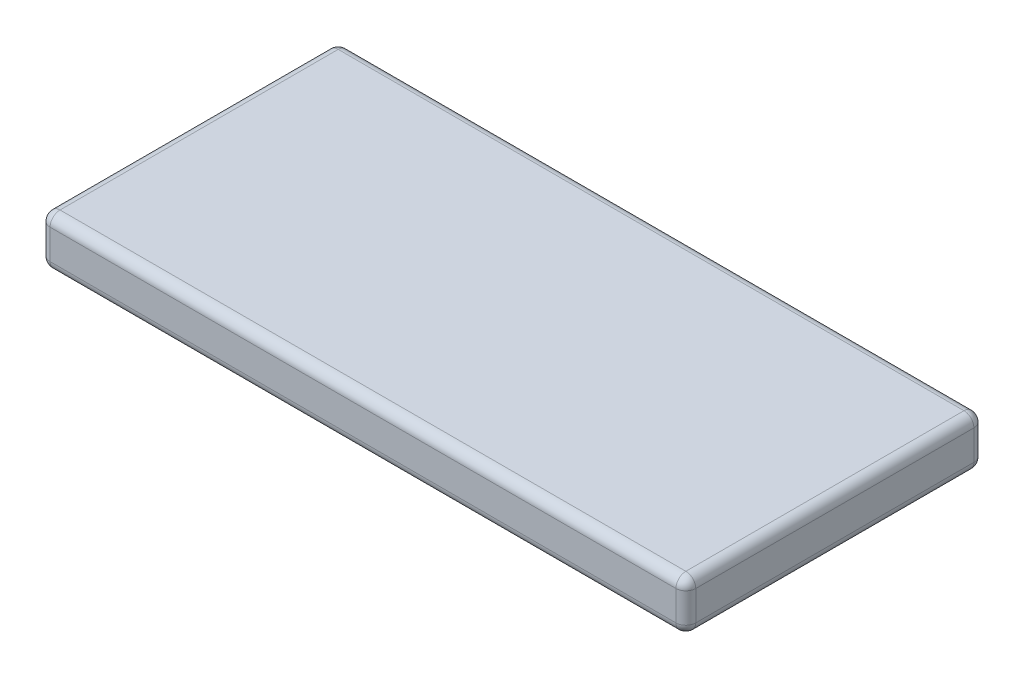
ISO-10303-21;
HEADER;
FILE_DESCRIPTION(('STEP AP214'),'2;1');
FILE_NAME('part.step','',(''),(''),'','','');
FILE_SCHEMA(('AUTOMOTIVE_DESIGN { 1 0 10303 214 1 1 1 1 }'));
ENDSEC;
DATA;
#1=APPLICATION_CONTEXT('core data for automotive mechanical design processes');
#2=APPLICATION_PROTOCOL_DEFINITION('international standard','automotive_design',2000,#1);
#3=PRODUCT_CONTEXT('',#1,'mechanical');
#4=PRODUCT('Part','Part','',(#3));
#5=PRODUCT_RELATED_PRODUCT_CATEGORY('part','',(#4));
#6=PRODUCT_DEFINITION_FORMATION('','',#4);
#7=PRODUCT_DEFINITION_CONTEXT('part definition',#1,'design');
#8=PRODUCT_DEFINITION('design','',#6,#7);
#9=PRODUCT_DEFINITION_SHAPE('','',#8);
#10=(LENGTH_UNIT() NAMED_UNIT(*) SI_UNIT(.MILLI.,.METRE.));
#11=(NAMED_UNIT(*) PLANE_ANGLE_UNIT() SI_UNIT($,.RADIAN.));
#12=(NAMED_UNIT(*) SI_UNIT($,.STERADIAN.) SOLID_ANGLE_UNIT());
#13=UNCERTAINTY_MEASURE_WITH_UNIT(LENGTH_MEASURE(1.E-05),#10,'distance_accuracy_value','');
#14=(GEOMETRIC_REPRESENTATION_CONTEXT(3) GLOBAL_UNCERTAINTY_ASSIGNED_CONTEXT((#13)) GLOBAL_UNIT_ASSIGNED_CONTEXT((#10,
#11,#12)) REPRESENTATION_CONTEXT('',''));
#15=CARTESIAN_POINT('',(0.,0.,0.));
#16=DIRECTION('',(0.,0.,1.));
#17=DIRECTION('',(1.,0.,0.));
#18=AXIS2_PLACEMENT_3D('',#15,#16,#17);
#19=CARTESIAN_POINT('',(32.5,5.,-15.));
#20=DIRECTION('',(-1.,0.,0.));
#21=DIRECTION('',(0.,0.,1.));
#22=AXIS2_PLACEMENT_3D('',#19,#20,#21);
#23=PLANE('',#22);
#24=DIRECTION('',(0.,-1.,0.));
#25=VECTOR('',#24,1.);
#26=CARTESIAN_POINT('',(32.5,5.,-14.));
#27=LINE('',#26,#25);
#28=CARTESIAN_POINT('',(32.5,1.,-14.));
#29=VERTEX_POINT('',#28);
#30=CARTESIAN_POINT('',(32.5,4.,-14.));
#31=VERTEX_POINT('',#30);
#32=EDGE_CURVE('E196',#29,#31,#27,.F.);
#33=ORIENTED_EDGE('',*,*,#32,.T.);
#34=DIRECTION('',(0.,0.,-1.));
#35=VECTOR('',#34,1.);
#36=CARTESIAN_POINT('',(32.5,4.,15.));
#37=LINE('',#36,#35);
#38=CARTESIAN_POINT('',(32.5,4.,14.));
#39=VERTEX_POINT('',#38);
#40=EDGE_CURVE('E199',#31,#39,#37,.F.);
#41=ORIENTED_EDGE('',*,*,#40,.T.);
#42=DIRECTION('',(0.,-1.,0.));
#43=VECTOR('',#42,1.);
#44=CARTESIAN_POINT('',(32.5,5.,14.));
#45=LINE('',#44,#43);
#46=CARTESIAN_POINT('',(32.5,1.,14.));
#47=VERTEX_POINT('',#46);
#48=EDGE_CURVE('E194',#39,#47,#45,.T.);
#49=ORIENTED_EDGE('',*,*,#48,.T.);
#50=DIRECTION('',(0.,0.,-1.));
#51=VECTOR('',#50,1.);
#52=CARTESIAN_POINT('',(32.5,1.,-15.));
#53=LINE('',#52,#51);
#54=EDGE_CURVE('E192',#47,#29,#53,.T.);
#55=ORIENTED_EDGE('',*,*,#54,.T.);
#56=EDGE_LOOP('',(#33,#41,#49,#55));
#57=FACE_BOUND('',#56,.T.);
#58=ADVANCED_FACE('F33',(#57),#23,.F.);
#59=CARTESIAN_POINT('',(-32.5,5.,-15.));
#60=DIRECTION('',(0.,0.,1.));
#61=DIRECTION('',(1.,0.,0.));
#62=AXIS2_PLACEMENT_3D('',#59,#60,#61);
#63=PLANE('',#62);
#64=DIRECTION('',(-1.,0.,0.));
#65=VECTOR('',#64,1.);
#66=CARTESIAN_POINT('',(-32.5,1.,-15.));
#67=LINE('',#66,#65);
#68=CARTESIAN_POINT('',(31.5,1.,-15.));
#69=VERTEX_POINT('',#68);
#70=CARTESIAN_POINT('',(-31.5,1.,-15.));
#71=VERTEX_POINT('',#70);
#72=EDGE_CURVE('E169',#69,#71,#67,.T.);
#73=ORIENTED_EDGE('',*,*,#72,.T.);
#74=DIRECTION('',(0.,-1.,0.));
#75=VECTOR('',#74,1.);
#76=CARTESIAN_POINT('',(-31.5,5.,-15.));
#77=LINE('',#76,#75);
#78=CARTESIAN_POINT('',(-31.5,4.,-15.));
#79=VERTEX_POINT('',#78);
#80=EDGE_CURVE('E171',#71,#79,#77,.F.);
#81=ORIENTED_EDGE('',*,*,#80,.T.);
#82=DIRECTION('',(-1.,0.,0.));
#83=VECTOR('',#82,1.);
#84=CARTESIAN_POINT('',(32.5,4.,-15.));
#85=LINE('',#84,#83);
#86=CARTESIAN_POINT('',(31.5,4.,-15.));
#87=VERTEX_POINT('',#86);
#88=EDGE_CURVE('E167',#79,#87,#85,.F.);
#89=ORIENTED_EDGE('',*,*,#88,.T.);
#90=DIRECTION('',(0.,-1.,0.));
#91=VECTOR('',#90,1.);
#92=CARTESIAN_POINT('',(31.5,5.,-15.));
#93=LINE('',#92,#91);
#94=EDGE_CURVE('E165',#87,#69,#93,.T.);
#95=ORIENTED_EDGE('',*,*,#94,.T.);
#96=EDGE_LOOP('',(#73,#81,#89,#95));
#97=FACE_BOUND('',#96,.T.);
#98=ADVANCED_FACE('F327',(#97),#63,.F.);
#99=CARTESIAN_POINT('',(-32.5,5.,-15.));
#100=DIRECTION('',(1.,0.,0.));
#101=DIRECTION('',(0.,0.,-1.));
#102=AXIS2_PLACEMENT_3D('',#99,#100,#101);
#103=PLANE('',#102);
#104=DIRECTION('',(0.,0.,1.));
#105=VECTOR('',#104,1.);
#106=CARTESIAN_POINT('',(-32.5,4.,-15.));
#107=LINE('',#106,#105);
#108=CARTESIAN_POINT('',(-32.5,4.,14.));
#109=VERTEX_POINT('',#108);
#110=CARTESIAN_POINT('',(-32.5,4.,-14.));
#111=VERTEX_POINT('',#110);
#112=EDGE_CURVE('E128',#109,#111,#107,.F.);
#113=ORIENTED_EDGE('',*,*,#112,.T.);
#114=DIRECTION('',(0.,-1.,0.));
#115=VECTOR('',#114,1.);
#116=CARTESIAN_POINT('',(-32.5,5.,-14.));
#117=LINE('',#116,#115);
#118=CARTESIAN_POINT('',(-32.5,1.,-14.));
#119=VERTEX_POINT('',#118);
#120=EDGE_CURVE('E163',#111,#119,#117,.T.);
#121=ORIENTED_EDGE('',*,*,#120,.T.);
#122=DIRECTION('',(0.,0.,1.));
#123=VECTOR('',#122,1.);
#124=CARTESIAN_POINT('',(-32.5,1.,-15.));
#125=LINE('',#124,#123);
#126=CARTESIAN_POINT('',(-32.5,1.,14.));
#127=VERTEX_POINT('',#126);
#128=EDGE_CURVE('E131',#119,#127,#125,.T.);
#129=ORIENTED_EDGE('',*,*,#128,.T.);
#130=DIRECTION('',(0.,-1.,0.));
#131=VECTOR('',#130,1.);
#132=CARTESIAN_POINT('',(-32.5,5.,14.));
#133=LINE('',#132,#131);
#134=EDGE_CURVE('E123',#127,#109,#133,.F.);
#135=ORIENTED_EDGE('',*,*,#134,.T.);
#136=EDGE_LOOP('',(#113,#121,#129,#135));
#137=FACE_BOUND('',#136,.T.);
#138=ADVANCED_FACE('F125',(#137),#103,.F.);
#139=CARTESIAN_POINT('',(-32.5,5.,15.));
#140=DIRECTION('',(0.,0.,-1.));
#141=DIRECTION('',(-1.,0.,0.));
#142=AXIS2_PLACEMENT_3D('',#139,#140,#141);
#143=PLANE('',#142);
#144=DIRECTION('',(1.,0.,0.));
#145=VECTOR('',#144,1.);
#146=CARTESIAN_POINT('',(-32.5,1.,15.));
#147=LINE('',#146,#145);
#148=CARTESIAN_POINT('',(-31.5,1.,15.));
#149=VERTEX_POINT('',#148);
#150=CARTESIAN_POINT('',(31.5,1.,15.));
#151=VERTEX_POINT('',#150);
#152=EDGE_CURVE('E42',#149,#151,#147,.T.);
#153=ORIENTED_EDGE('',*,*,#152,.T.);
#154=DIRECTION('',(0.,-1.,0.));
#155=VECTOR('',#154,1.);
#156=CARTESIAN_POINT('',(31.5,5.,15.));
#157=LINE('',#156,#155);
#158=CARTESIAN_POINT('',(31.5,4.,15.));
#159=VERTEX_POINT('',#158);
#160=EDGE_CURVE('E11',#151,#159,#157,.F.);
#161=ORIENTED_EDGE('',*,*,#160,.T.);
#162=DIRECTION('',(1.,0.,0.));
#163=VECTOR('',#162,1.);
#164=CARTESIAN_POINT('',(-32.5,4.,15.));
#165=LINE('',#164,#163);
#166=CARTESIAN_POINT('',(-31.5,4.,15.));
#167=VERTEX_POINT('',#166);
#168=EDGE_CURVE('E56',#159,#167,#165,.F.);
#169=ORIENTED_EDGE('',*,*,#168,.T.);
#170=DIRECTION('',(0.,-1.,0.));
#171=VECTOR('',#170,1.);
#172=CARTESIAN_POINT('',(-31.5,5.,15.));
#173=LINE('',#172,#171);
#174=EDGE_CURVE('E141',#167,#149,#173,.T.);
#175=ORIENTED_EDGE('',*,*,#174,.T.);
#176=EDGE_LOOP('',(#153,#161,#169,#175));
#177=FACE_BOUND('',#176,.T.);
#178=ADVANCED_FACE('F489',(#177),#143,.F.);
#179=CARTESIAN_POINT('',(0.,5.,0.));
#180=DIRECTION('',(0.,1.,0.));
#181=DIRECTION('',(0.,0.,1.));
#182=AXIS2_PLACEMENT_3D('',#179,#180,#181);
#183=PLANE('',#182);
#184=DIRECTION('',(0.,0.,-1.));
#185=VECTOR('',#184,1.);
#186=CARTESIAN_POINT('',(31.5,5.,-15.));
#187=LINE('',#186,#185);
#188=CARTESIAN_POINT('',(31.5,5.,14.));
#189=VERTEX_POINT('',#188);
#190=CARTESIAN_POINT('',(31.5,5.,-14.));
#191=VERTEX_POINT('',#190);
#192=EDGE_CURVE('E187',#189,#191,#187,.T.);
#193=ORIENTED_EDGE('',*,*,#192,.T.);
#194=DIRECTION('',(-1.,0.,0.));
#195=VECTOR('',#194,1.);
#196=CARTESIAN_POINT('',(-32.5,5.,-14.));
#197=LINE('',#196,#195);
#198=CARTESIAN_POINT('',(-31.5,5.,-14.));
#199=VERTEX_POINT('',#198);
#200=EDGE_CURVE('E189',#191,#199,#197,.T.);
#201=ORIENTED_EDGE('',*,*,#200,.T.);
#202=DIRECTION('',(0.,0.,1.));
#203=VECTOR('',#202,1.);
#204=CARTESIAN_POINT('',(-31.5,5.,15.));
#205=LINE('',#204,#203);
#206=CARTESIAN_POINT('',(-31.5,5.,14.));
#207=VERTEX_POINT('',#206);
#208=EDGE_CURVE('E183',#199,#207,#205,.T.);
#209=ORIENTED_EDGE('',*,*,#208,.T.);
#210=DIRECTION('',(1.,0.,0.));
#211=VECTOR('',#210,1.);
#212=CARTESIAN_POINT('',(32.5,5.,14.));
#213=LINE('',#212,#211);
#214=EDGE_CURVE('E185',#207,#189,#213,.T.);
#215=ORIENTED_EDGE('',*,*,#214,.T.);
#216=EDGE_LOOP('',(#193,#201,#209,#215));
#217=FACE_BOUND('',#216,.T.);
#218=ADVANCED_FACE('F294',(#217),#183,.T.);
#219=CARTESIAN_POINT('',(0.,0.,0.));
#220=DIRECTION('',(0.,1.,0.));
#221=DIRECTION('',(0.,0.,1.));
#222=AXIS2_PLACEMENT_3D('',#219,#220,#221);
#223=PLANE('',#222);
#224=DIRECTION('',(1.,0.,0.));
#225=VECTOR('',#224,1.);
#226=CARTESIAN_POINT('',(0.,0.,14.));
#227=LINE('',#226,#225);
#228=CARTESIAN_POINT('',(31.5,0.,14.));
#229=VERTEX_POINT('',#228);
#230=CARTESIAN_POINT('',(-31.5,0.,14.));
#231=VERTEX_POINT('',#230);
#232=EDGE_CURVE('E174',#229,#231,#227,.F.);
#233=ORIENTED_EDGE('',*,*,#232,.T.);
#234=DIRECTION('',(0.,0.,1.));
#235=VECTOR('',#234,1.);
#236=CARTESIAN_POINT('',(-31.5,0.,0.));
#237=LINE('',#236,#235);
#238=CARTESIAN_POINT('',(-31.5,0.,-14.));
#239=VERTEX_POINT('',#238);
#240=EDGE_CURVE('E180',#231,#239,#237,.F.);
#241=ORIENTED_EDGE('',*,*,#240,.T.);
#242=DIRECTION('',(-1.,0.,0.));
#243=VECTOR('',#242,1.);
#244=CARTESIAN_POINT('',(0.,0.,-14.));
#245=LINE('',#244,#243);
#246=CARTESIAN_POINT('',(31.5,0.,-14.));
#247=VERTEX_POINT('',#246);
#248=EDGE_CURVE('E178',#239,#247,#245,.F.);
#249=ORIENTED_EDGE('',*,*,#248,.T.);
#250=DIRECTION('',(0.,0.,-1.));
#251=VECTOR('',#250,1.);
#252=CARTESIAN_POINT('',(31.5,0.,0.));
#253=LINE('',#252,#251);
#254=EDGE_CURVE('E176',#247,#229,#253,.F.);
#255=ORIENTED_EDGE('',*,*,#254,.T.);
#256=EDGE_LOOP('',(#233,#241,#249,#255));
#257=FACE_BOUND('',#256,.T.);
#258=ADVANCED_FACE('F265',(#257),#223,.F.);
#259=CARTESIAN_POINT('',(31.5,5.,14.));
#260=DIRECTION('',(0.,-1.,0.));
#261=DIRECTION('',(0.,0.,-1.));
#262=AXIS2_PLACEMENT_3D('',#259,#260,#261);
#263=CYLINDRICAL_SURFACE('',#262,1.);
#264=CARTESIAN_POINT('',(31.5,4.,14.));
#265=DIRECTION('',(0.,1.,0.));
#266=DIRECTION('',(0.,0.,1.));
#267=AXIS2_PLACEMENT_3D('',#264,#265,#266);
#268=CIRCLE('',#267,1.);
#269=EDGE_CURVE('E37',#159,#39,#268,.T.);
#270=ORIENTED_EDGE('',*,*,#269,.F.);
#271=ORIENTED_EDGE('',*,*,#160,.F.);
#272=CARTESIAN_POINT('',(31.5,1.,14.));
#273=DIRECTION('',(0.,-1.,0.));
#274=DIRECTION('',(0.,0.,-1.));
#275=AXIS2_PLACEMENT_3D('',#272,#273,#274);
#276=CIRCLE('',#275,1.);
#277=EDGE_CURVE('E160',#47,#151,#276,.T.);
#278=ORIENTED_EDGE('',*,*,#277,.F.);
#279=ORIENTED_EDGE('',*,*,#48,.F.);
#280=EDGE_LOOP('',(#270,#271,#278,#279));
#281=FACE_BOUND('',#280,.T.);
#282=ADVANCED_FACE('F35',(#281),#263,.T.);
#283=CARTESIAN_POINT('',(31.5,4.,14.));
#284=DIRECTION('',(0.,0.,1.));
#285=DIRECTION('',(1.,0.,0.));
#286=AXIS2_PLACEMENT_3D('',#283,#284,#285);
#287=SPHERICAL_SURFACE('',#286,1.);
#288=CARTESIAN_POINT('',(31.5,4.,14.));
#289=DIRECTION('',(1.,0.,0.));
#290=DIRECTION('',(0.,0.,-1.));
#291=AXIS2_PLACEMENT_3D('',#288,#289,#290);
#292=CIRCLE('',#291,1.);
#293=EDGE_CURVE('E246',#159,#189,#292,.F.);
#294=ORIENTED_EDGE('',*,*,#293,.F.);
#295=ORIENTED_EDGE('',*,*,#269,.T.);
#296=CARTESIAN_POINT('',(31.5,4.,14.));
#297=DIRECTION('',(0.,0.,1.));
#298=DIRECTION('',(1.,0.,0.));
#299=AXIS2_PLACEMENT_3D('',#296,#297,#298);
#300=CIRCLE('',#299,1.);
#301=EDGE_CURVE('E248',#189,#39,#300,.F.);
#302=ORIENTED_EDGE('',*,*,#301,.F.);
#303=EDGE_LOOP('',(#294,#295,#302));
#304=FACE_BOUND('',#303,.T.);
#305=ADVANCED_FACE('F290',(#304),#287,.T.);
#306=CARTESIAN_POINT('',(31.5,1.,14.));
#307=DIRECTION('',(0.,0.,1.));
#308=DIRECTION('',(1.,0.,0.));
#309=AXIS2_PLACEMENT_3D('',#306,#307,#308);
#310=SPHERICAL_SURFACE('',#309,1.);
#311=CARTESIAN_POINT('',(31.5,1.,14.));
#312=DIRECTION('',(0.,0.,1.));
#313=DIRECTION('',(1.,0.,0.));
#314=AXIS2_PLACEMENT_3D('',#311,#312,#313);
#315=CIRCLE('',#314,1.);
#316=EDGE_CURVE('E240',#47,#229,#315,.F.);
#317=ORIENTED_EDGE('',*,*,#316,.F.);
#318=ORIENTED_EDGE('',*,*,#277,.T.);
#319=CARTESIAN_POINT('',(31.5,1.,14.));
#320=DIRECTION('',(1.,0.,0.));
#321=DIRECTION('',(0.,0.,-1.));
#322=AXIS2_PLACEMENT_3D('',#319,#320,#321);
#323=CIRCLE('',#322,1.);
#324=EDGE_CURVE('E243',#229,#151,#323,.F.);
#325=ORIENTED_EDGE('',*,*,#324,.F.);
#326=EDGE_LOOP('',(#317,#318,#325));
#327=FACE_BOUND('',#326,.T.);
#328=ADVANCED_FACE('F255',(#327),#310,.T.);
#329=CARTESIAN_POINT('',(31.5,4.,0.));
#330=DIRECTION('',(0.,0.,1.));
#331=DIRECTION('',(1.,0.,0.));
#332=AXIS2_PLACEMENT_3D('',#329,#330,#331);
#333=CYLINDRICAL_SURFACE('',#332,1.);
#334=ORIENTED_EDGE('',*,*,#301,.T.);
#335=ORIENTED_EDGE('',*,*,#40,.F.);
#336=CARTESIAN_POINT('',(31.5,4.,-14.));
#337=DIRECTION('',(0.,0.,-1.));
#338=DIRECTION('',(-1.,0.,0.));
#339=AXIS2_PLACEMENT_3D('',#336,#337,#338);
#340=CIRCLE('',#339,1.);
#341=EDGE_CURVE('E235',#191,#31,#340,.T.);
#342=ORIENTED_EDGE('',*,*,#341,.F.);
#343=ORIENTED_EDGE('',*,*,#192,.F.);
#344=EDGE_LOOP('',(#334,#335,#342,#343));
#345=FACE_BOUND('',#344,.T.);
#346=ADVANCED_FACE('F285',(#345),#333,.T.);
#347=CARTESIAN_POINT('',(0.,4.,14.));
#348=DIRECTION('',(-1.,0.,0.));
#349=DIRECTION('',(0.,0.,1.));
#350=AXIS2_PLACEMENT_3D('',#347,#348,#349);
#351=CYLINDRICAL_SURFACE('',#350,1.);
#352=ORIENTED_EDGE('',*,*,#293,.T.);
#353=ORIENTED_EDGE('',*,*,#214,.F.);
#354=CARTESIAN_POINT('',(-31.5,4.,14.));
#355=DIRECTION('',(-1.,0.,0.));
#356=DIRECTION('',(0.,0.,1.));
#357=AXIS2_PLACEMENT_3D('',#354,#355,#356);
#358=CIRCLE('',#357,1.);
#359=EDGE_CURVE('E144',#167,#207,#358,.T.);
#360=ORIENTED_EDGE('',*,*,#359,.F.);
#361=ORIENTED_EDGE('',*,*,#168,.F.);
#362=EDGE_LOOP('',(#352,#353,#360,#361));
#363=FACE_BOUND('',#362,.T.);
#364=ADVANCED_FACE('F292',(#363),#351,.T.);
#365=CARTESIAN_POINT('',(-31.5,5.,14.));
#366=DIRECTION('',(0.,-1.,0.));
#367=DIRECTION('',(0.,0.,-1.));
#368=AXIS2_PLACEMENT_3D('',#365,#366,#367);
#369=CYLINDRICAL_SURFACE('',#368,1.);
#370=CARTESIAN_POINT('',(-31.5,1.,14.));
#371=DIRECTION('',(0.,-1.,0.));
#372=DIRECTION('',(0.,0.,-1.));
#373=AXIS2_PLACEMENT_3D('',#370,#371,#372);
#374=CIRCLE('',#373,1.);
#375=EDGE_CURVE('E145',#149,#127,#374,.T.);
#376=ORIENTED_EDGE('',*,*,#375,.F.);
#377=ORIENTED_EDGE('',*,*,#174,.F.);
#378=CARTESIAN_POINT('',(-31.5,4.,14.));
#379=DIRECTION('',(0.,1.,0.));
#380=DIRECTION('',(0.,0.,1.));
#381=AXIS2_PLACEMENT_3D('',#378,#379,#380);
#382=CIRCLE('',#381,1.);
#383=EDGE_CURVE('E138',#109,#167,#382,.T.);
#384=ORIENTED_EDGE('',*,*,#383,.F.);
#385=ORIENTED_EDGE('',*,*,#134,.F.);
#386=EDGE_LOOP('',(#376,#377,#384,#385));
#387=FACE_BOUND('',#386,.T.);
#388=ADVANCED_FACE('F140',(#387),#369,.T.);
#389=CARTESIAN_POINT('',(-32.5,1.,14.));
#390=DIRECTION('',(1.,0.,0.));
#391=DIRECTION('',(0.,0.,-1.));
#392=AXIS2_PLACEMENT_3D('',#389,#390,#391);
#393=CYLINDRICAL_SURFACE('',#392,1.);
#394=ORIENTED_EDGE('',*,*,#324,.T.);
#395=ORIENTED_EDGE('',*,*,#152,.F.);
#396=CARTESIAN_POINT('',(-31.5,1.,14.));
#397=DIRECTION('',(-1.,0.,0.));
#398=DIRECTION('',(0.,0.,1.));
#399=AXIS2_PLACEMENT_3D('',#396,#397,#398);
#400=CIRCLE('',#399,1.);
#401=EDGE_CURVE('E230',#231,#149,#400,.T.);
#402=ORIENTED_EDGE('',*,*,#401,.F.);
#403=ORIENTED_EDGE('',*,*,#232,.F.);
#404=EDGE_LOOP('',(#394,#395,#402,#403));
#405=FACE_BOUND('',#404,.T.);
#406=ADVANCED_FACE('F261',(#405),#393,.T.);
#407=CARTESIAN_POINT('',(31.5,1.,-15.));
#408=DIRECTION('',(0.,0.,-1.));
#409=DIRECTION('',(-1.,0.,0.));
#410=AXIS2_PLACEMENT_3D('',#407,#408,#409);
#411=CYLINDRICAL_SURFACE('',#410,1.);
#412=ORIENTED_EDGE('',*,*,#316,.T.);
#413=ORIENTED_EDGE('',*,*,#254,.F.);
#414=CARTESIAN_POINT('',(31.5,1.,-14.));
#415=DIRECTION('',(0.,0.,-1.));
#416=DIRECTION('',(-1.,0.,0.));
#417=AXIS2_PLACEMENT_3D('',#414,#415,#416);
#418=CIRCLE('',#417,1.);
#419=EDGE_CURVE('E227',#29,#247,#418,.T.);
#420=ORIENTED_EDGE('',*,*,#419,.F.);
#421=ORIENTED_EDGE('',*,*,#54,.F.);
#422=EDGE_LOOP('',(#412,#413,#420,#421));
#423=FACE_BOUND('',#422,.T.);
#424=ADVANCED_FACE('F271',(#423),#411,.T.);
#425=CARTESIAN_POINT('',(31.5,5.,-14.));
#426=DIRECTION('',(0.,-1.,0.));
#427=DIRECTION('',(0.,0.,-1.));
#428=AXIS2_PLACEMENT_3D('',#425,#426,#427);
#429=CYLINDRICAL_SURFACE('',#428,1.);
#430=CARTESIAN_POINT('',(31.5,4.,-14.));
#431=DIRECTION('',(0.,1.,0.));
#432=DIRECTION('',(0.,0.,1.));
#433=AXIS2_PLACEMENT_3D('',#430,#431,#432);
#434=CIRCLE('',#433,1.);
#435=EDGE_CURVE('E237',#31,#87,#434,.T.);
#436=ORIENTED_EDGE('',*,*,#435,.F.);
#437=ORIENTED_EDGE('',*,*,#32,.F.);
#438=CARTESIAN_POINT('',(31.5,1.,-14.));
#439=DIRECTION('',(0.,-1.,0.));
#440=DIRECTION('',(0.,0.,-1.));
#441=AXIS2_PLACEMENT_3D('',#438,#439,#440);
#442=CIRCLE('',#441,1.);
#443=EDGE_CURVE('E224',#69,#29,#442,.T.);
#444=ORIENTED_EDGE('',*,*,#443,.F.);
#445=ORIENTED_EDGE('',*,*,#94,.F.);
#446=EDGE_LOOP('',(#436,#437,#444,#445));
#447=FACE_BOUND('',#446,.T.);
#448=ADVANCED_FACE('F277',(#447),#429,.T.);
#449=CARTESIAN_POINT('',(31.5,4.,-14.));
#450=DIRECTION('',(0.,0.,1.));
#451=DIRECTION('',(1.,0.,0.));
#452=AXIS2_PLACEMENT_3D('',#449,#450,#451);
#453=SPHERICAL_SURFACE('',#452,1.);
#454=ORIENTED_EDGE('',*,*,#341,.T.);
#455=ORIENTED_EDGE('',*,*,#435,.T.);
#456=CARTESIAN_POINT('',(31.5,4.,-14.));
#457=DIRECTION('',(1.,0.,0.));
#458=DIRECTION('',(0.,0.,-1.));
#459=AXIS2_PLACEMENT_3D('',#456,#457,#458);
#460=CIRCLE('',#459,1.);
#461=EDGE_CURVE('E152',#191,#87,#460,.F.);
#462=ORIENTED_EDGE('',*,*,#461,.F.);
#463=EDGE_LOOP('',(#454,#455,#462));
#464=FACE_BOUND('',#463,.T.);
#465=ADVANCED_FACE('F324',(#464),#453,.T.);
#466=CARTESIAN_POINT('',(-31.5,4.,14.));
#467=DIRECTION('',(0.,0.,1.));
#468=DIRECTION('',(1.,0.,0.));
#469=AXIS2_PLACEMENT_3D('',#466,#467,#468);
#470=SPHERICAL_SURFACE('',#469,1.);
#471=ORIENTED_EDGE('',*,*,#383,.T.);
#472=ORIENTED_EDGE('',*,*,#359,.T.);
#473=CARTESIAN_POINT('',(-31.5,4.,14.));
#474=DIRECTION('',(0.,0.,1.));
#475=DIRECTION('',(1.,0.,0.));
#476=AXIS2_PLACEMENT_3D('',#473,#474,#475);
#477=CIRCLE('',#476,1.);
#478=EDGE_CURVE('E148',#109,#207,#477,.F.);
#479=ORIENTED_EDGE('',*,*,#478,.F.);
#480=EDGE_LOOP('',(#471,#472,#479));
#481=FACE_BOUND('',#480,.T.);
#482=ADVANCED_FACE('F149',(#481),#470,.T.);
#483=CARTESIAN_POINT('',(-31.5,1.,14.));
#484=DIRECTION('',(0.,0.,1.));
#485=DIRECTION('',(1.,0.,0.));
#486=AXIS2_PLACEMENT_3D('',#483,#484,#485);
#487=SPHERICAL_SURFACE('',#486,1.);
#488=ORIENTED_EDGE('',*,*,#401,.T.);
#489=ORIENTED_EDGE('',*,*,#375,.T.);
#490=CARTESIAN_POINT('',(-31.5,1.,14.));
#491=DIRECTION('',(0.,0.,1.));
#492=DIRECTION('',(1.,0.,0.));
#493=AXIS2_PLACEMENT_3D('',#490,#491,#492);
#494=CIRCLE('',#493,1.);
#495=EDGE_CURVE('E153',#231,#127,#494,.F.);
#496=ORIENTED_EDGE('',*,*,#495,.F.);
#497=EDGE_LOOP('',(#488,#489,#496));
#498=FACE_BOUND('',#497,.T.);
#499=ADVANCED_FACE('F314',(#498),#487,.T.);
#500=CARTESIAN_POINT('',(31.5,1.,-14.));
#501=DIRECTION('',(0.,0.,1.));
#502=DIRECTION('',(1.,0.,0.));
#503=AXIS2_PLACEMENT_3D('',#500,#501,#502);
#504=SPHERICAL_SURFACE('',#503,1.);
#505=ORIENTED_EDGE('',*,*,#443,.T.);
#506=ORIENTED_EDGE('',*,*,#419,.T.);
#507=CARTESIAN_POINT('',(31.5,1.,-14.));
#508=DIRECTION('',(1.,0.,0.));
#509=DIRECTION('',(0.,0.,-1.));
#510=AXIS2_PLACEMENT_3D('',#507,#508,#509);
#511=CIRCLE('',#510,1.);
#512=EDGE_CURVE('E217',#69,#247,#511,.F.);
#513=ORIENTED_EDGE('',*,*,#512,.F.);
#514=EDGE_LOOP('',(#505,#506,#513));
#515=FACE_BOUND('',#514,.T.);
#516=ADVANCED_FACE('F316',(#515),#504,.T.);
#517=CARTESIAN_POINT('',(0.,4.,-14.));
#518=DIRECTION('',(1.,0.,0.));
#519=DIRECTION('',(0.,0.,-1.));
#520=AXIS2_PLACEMENT_3D('',#517,#518,#519);
#521=CYLINDRICAL_SURFACE('',#520,1.);
#522=ORIENTED_EDGE('',*,*,#461,.T.);
#523=ORIENTED_EDGE('',*,*,#88,.F.);
#524=CARTESIAN_POINT('',(-31.5,4.,-14.));
#525=DIRECTION('',(-1.,0.,0.));
#526=DIRECTION('',(0.,0.,1.));
#527=AXIS2_PLACEMENT_3D('',#524,#525,#526);
#528=CIRCLE('',#527,1.);
#529=EDGE_CURVE('E214',#199,#79,#528,.T.);
#530=ORIENTED_EDGE('',*,*,#529,.F.);
#531=ORIENTED_EDGE('',*,*,#200,.F.);
#532=EDGE_LOOP('',(#522,#523,#530,#531));
#533=FACE_BOUND('',#532,.T.);
#534=ADVANCED_FACE('F298',(#533),#521,.T.);
#535=CARTESIAN_POINT('',(-31.5,4.,0.));
#536=DIRECTION('',(0.,0.,-1.));
#537=DIRECTION('',(-1.,0.,0.));
#538=AXIS2_PLACEMENT_3D('',#535,#536,#537);
#539=CYLINDRICAL_SURFACE('',#538,1.);
#540=ORIENTED_EDGE('',*,*,#478,.T.);
#541=ORIENTED_EDGE('',*,*,#208,.F.);
#542=CARTESIAN_POINT('',(-31.5,4.,-14.));
#543=DIRECTION('',(0.,0.,-1.));
#544=DIRECTION('',(-1.,0.,0.));
#545=AXIS2_PLACEMENT_3D('',#542,#543,#544);
#546=CIRCLE('',#545,1.);
#547=EDGE_CURVE('E156',#111,#199,#546,.T.);
#548=ORIENTED_EDGE('',*,*,#547,.F.);
#549=ORIENTED_EDGE('',*,*,#112,.F.);
#550=EDGE_LOOP('',(#540,#541,#548,#549));
#551=FACE_BOUND('',#550,.T.);
#552=ADVANCED_FACE('F155',(#551),#539,.T.);
#553=CARTESIAN_POINT('',(-31.5,1.,-15.));
#554=DIRECTION('',(0.,0.,1.));
#555=DIRECTION('',(1.,0.,0.));
#556=AXIS2_PLACEMENT_3D('',#553,#554,#555);
#557=CYLINDRICAL_SURFACE('',#556,1.);
#558=ORIENTED_EDGE('',*,*,#495,.T.);
#559=ORIENTED_EDGE('',*,*,#128,.F.);
#560=CARTESIAN_POINT('',(-31.5,1.,-14.));
#561=DIRECTION('',(0.,0.,-1.));
#562=DIRECTION('',(-1.,0.,0.));
#563=AXIS2_PLACEMENT_3D('',#560,#561,#562);
#564=CIRCLE('',#563,1.);
#565=EDGE_CURVE('E210',#239,#119,#564,.T.);
#566=ORIENTED_EDGE('',*,*,#565,.F.);
#567=ORIENTED_EDGE('',*,*,#240,.F.);
#568=EDGE_LOOP('',(#558,#559,#566,#567));
#569=FACE_BOUND('',#568,.T.);
#570=ADVANCED_FACE('F312',(#569),#557,.T.);
#571=CARTESIAN_POINT('',(-32.5,1.,-14.));
#572=DIRECTION('',(-1.,0.,0.));
#573=DIRECTION('',(0.,0.,1.));
#574=AXIS2_PLACEMENT_3D('',#571,#572,#573);
#575=CYLINDRICAL_SURFACE('',#574,1.);
#576=ORIENTED_EDGE('',*,*,#512,.T.);
#577=ORIENTED_EDGE('',*,*,#248,.F.);
#578=CARTESIAN_POINT('',(-31.5,1.,-14.));
#579=DIRECTION('',(-1.,0.,0.));
#580=DIRECTION('',(0.,0.,1.));
#581=AXIS2_PLACEMENT_3D('',#578,#579,#580);
#582=CIRCLE('',#581,1.);
#583=EDGE_CURVE('E208',#71,#239,#582,.T.);
#584=ORIENTED_EDGE('',*,*,#583,.F.);
#585=ORIENTED_EDGE('',*,*,#72,.F.);
#586=EDGE_LOOP('',(#576,#577,#584,#585));
#587=FACE_BOUND('',#586,.T.);
#588=ADVANCED_FACE('F342',(#587),#575,.T.);
#589=CARTESIAN_POINT('',(-31.5,4.,-14.));
#590=DIRECTION('',(0.,0.,1.));
#591=DIRECTION('',(1.,0.,0.));
#592=AXIS2_PLACEMENT_3D('',#589,#590,#591);
#593=SPHERICAL_SURFACE('',#592,1.);
#594=ORIENTED_EDGE('',*,*,#547,.T.);
#595=ORIENTED_EDGE('',*,*,#529,.T.);
#596=CARTESIAN_POINT('',(-31.5,4.,-14.));
#597=DIRECTION('',(0.,1.,0.));
#598=DIRECTION('',(0.,0.,1.));
#599=AXIS2_PLACEMENT_3D('',#596,#597,#598);
#600=CIRCLE('',#599,1.);
#601=EDGE_CURVE('E206',#111,#79,#600,.F.);
#602=ORIENTED_EDGE('',*,*,#601,.F.);
#603=EDGE_LOOP('',(#594,#595,#602));
#604=FACE_BOUND('',#603,.T.);
#605=ADVANCED_FACE('F301',(#604),#593,.T.);
#606=CARTESIAN_POINT('',(-31.5,1.,-14.));
#607=DIRECTION('',(0.,0.,1.));
#608=DIRECTION('',(1.,0.,0.));
#609=AXIS2_PLACEMENT_3D('',#606,#607,#608);
#610=SPHERICAL_SURFACE('',#609,1.);
#611=ORIENTED_EDGE('',*,*,#583,.T.);
#612=ORIENTED_EDGE('',*,*,#565,.T.);
#613=CARTESIAN_POINT('',(-31.5,1.,-14.));
#614=DIRECTION('',(0.,-1.,0.));
#615=DIRECTION('',(0.,0.,-1.));
#616=AXIS2_PLACEMENT_3D('',#613,#614,#615);
#617=CIRCLE('',#616,1.);
#618=EDGE_CURVE('E204',#71,#119,#617,.F.);
#619=ORIENTED_EDGE('',*,*,#618,.F.);
#620=EDGE_LOOP('',(#611,#612,#619));
#621=FACE_BOUND('',#620,.T.);
#622=ADVANCED_FACE('F309',(#621),#610,.T.);
#623=CARTESIAN_POINT('',(-31.5,5.,-14.));
#624=DIRECTION('',(0.,-1.,0.));
#625=DIRECTION('',(0.,0.,-1.));
#626=AXIS2_PLACEMENT_3D('',#623,#624,#625);
#627=CYLINDRICAL_SURFACE('',#626,1.);
#628=ORIENTED_EDGE('',*,*,#601,.T.);
#629=ORIENTED_EDGE('',*,*,#80,.F.);
#630=ORIENTED_EDGE('',*,*,#618,.T.);
#631=ORIENTED_EDGE('',*,*,#120,.F.);
#632=EDGE_LOOP('',(#628,#629,#630,#631));
#633=FACE_BOUND('',#632,.T.);
#634=ADVANCED_FACE('F305',(#633),#627,.T.);
#635=CLOSED_SHELL('',(#58,#98,#138,#178,#218,#258,#282,#305,#328,#346,#364,#388,#406,#424,#448,
#465,#482,#499,#516,#534,#552,#570,#588,#605,#622,#634));
#636=MANIFOLD_SOLID_BREP('B2',#635);
#637=ADVANCED_BREP_SHAPE_REPRESENTATION('',(#18,#636),#14);
#638=SHAPE_DEFINITION_REPRESENTATION(#9,#637);
ENDSEC;
END-ISO-10303-21;
